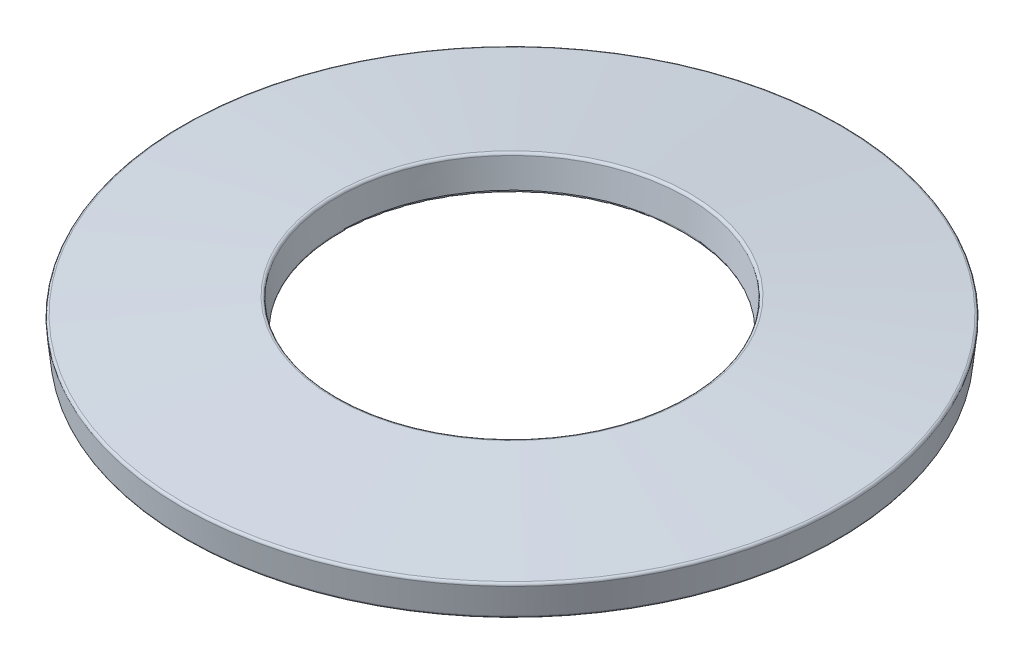
ISO-10303-21;
HEADER;
FILE_DESCRIPTION(('STEP AP214'),'2;1');
FILE_NAME('part.step','',(''),(''),'','','');
FILE_SCHEMA(('AUTOMOTIVE_DESIGN { 1 0 10303 214 1 1 1 1 }'));
ENDSEC;
DATA;
#1=APPLICATION_CONTEXT('core data for automotive mechanical design processes');
#2=APPLICATION_PROTOCOL_DEFINITION('international standard','automotive_design',2000,#1);
#3=PRODUCT_CONTEXT('',#1,'mechanical');
#4=PRODUCT('Part','Part','',(#3));
#5=PRODUCT_RELATED_PRODUCT_CATEGORY('part','',(#4));
#6=PRODUCT_DEFINITION_FORMATION('','',#4);
#7=PRODUCT_DEFINITION_CONTEXT('part definition',#1,'design');
#8=PRODUCT_DEFINITION('design','',#6,#7);
#9=PRODUCT_DEFINITION_SHAPE('','',#8);
#10=(LENGTH_UNIT() NAMED_UNIT(*) SI_UNIT(.MILLI.,.METRE.));
#11=(NAMED_UNIT(*) PLANE_ANGLE_UNIT() SI_UNIT($,.RADIAN.));
#12=(NAMED_UNIT(*) SI_UNIT($,.STERADIAN.) SOLID_ANGLE_UNIT());
#13=UNCERTAINTY_MEASURE_WITH_UNIT(LENGTH_MEASURE(1.E-05),#10,'distance_accuracy_value','');
#14=(GEOMETRIC_REPRESENTATION_CONTEXT(3) GLOBAL_UNCERTAINTY_ASSIGNED_CONTEXT((#13)) GLOBAL_UNIT_ASSIGNED_CONTEXT((#10,
#11,#12)) REPRESENTATION_CONTEXT('',''));
#15=CARTESIAN_POINT('',(0.,0.,0.));
#16=DIRECTION('',(0.,0.,1.));
#17=DIRECTION('',(1.,0.,0.));
#18=AXIS2_PLACEMENT_3D('',#15,#16,#17);
#19=CARTESIAN_POINT('',(0.,-0.122121355429971,0.));
#20=DIRECTION('',(0.,-1.,0.));
#21=DIRECTION('',(0.,0.,-1.));
#22=AXIS2_PLACEMENT_3D('',#19,#20,#21);
#23=CONICAL_SURFACE('',#22,2.6,1.46343877434843);
#24=CARTESIAN_POINT('',(0.,-0.126139534571328,0.));
#25=DIRECTION('',(0.,1.,0.));
#26=DIRECTION('',(0.,0.,1.));
#27=AXIS2_PLACEMENT_3D('',#24,#25,#26);
#28=CIRCLE('',#27,2.63728410165725);
#29=CARTESIAN_POINT('',(0.,-0.126139534571328,2.63728410165725));
#30=VERTEX_POINT('',#29);
#31=EDGE_CURVE('E56',#30,#30,#28,.T.);
#32=ORIENTED_EDGE('',*,*,#31,.T.);
#33=EDGE_LOOP('',(#32));
#34=FACE_BOUND('',#33,.T.);
#35=CARTESIAN_POINT('',(0.,-0.370981820858647,0.));
#36=DIRECTION('',(0.,1.,0.));
#37=DIRECTION('',(0.,0.,1.));
#38=AXIS2_PLACEMENT_3D('',#35,#36,#37);
#39=CIRCLE('',#38,4.909140176458);
#40=CARTESIAN_POINT('',(0.,-0.370981820858647,4.909140176458));
#41=VERTEX_POINT('',#40);
#42=EDGE_CURVE('E59',#41,#41,#39,.F.);
#43=ORIENTED_EDGE('',*,*,#42,.T.);
#44=EDGE_LOOP('',(#43));
#45=FACE_BOUND('',#44,.T.);
#46=ADVANCED_FACE('F30',(#34,#45),#23,.F.);
#47=CARTESIAN_POINT('',(0.,0.374999999999995,0.));
#48=DIRECTION('',(0.,1.,0.));
#49=DIRECTION('',(0.,0.,1.));
#50=AXIS2_PLACEMENT_3D('',#47,#48,#49);
#51=CONICAL_SURFACE('',#50,2.65357572188476,0.107357552446469);
#52=CARTESIAN_POINT('',(0.,-0.0848372537727259,0.));
#53=DIRECTION('',(0.,-1.,0.));
#54=DIRECTION('',(0.,0.,-1.));
#55=AXIS2_PLACEMENT_3D('',#52,#53,#54);
#56=CIRCLE('',#55,2.60401817914136);
#57=CARTESIAN_POINT('',(0.,-0.0848372537727259,-2.60401817914136));
#58=VERTEX_POINT('',#57);
#59=EDGE_CURVE('E50',#58,#58,#56,.T.);
#60=ORIENTED_EDGE('',*,*,#59,.T.);
#61=EDGE_LOOP('',(#60));
#62=FACE_BOUND('',#61,.T.);
#63=CARTESIAN_POINT('',(0.,0.33771589834275,0.));
#64=DIRECTION('',(0.,-1.,0.));
#65=DIRECTION('',(0.,0.,-1.));
#66=AXIS2_PLACEMENT_3D('',#63,#64,#65);
#67=CIRCLE('',#66,2.6495575427434);
#68=CARTESIAN_POINT('',(0.,0.33771589834275,-2.6495575427434));
#69=VERTEX_POINT('',#68);
#70=EDGE_CURVE('E53',#69,#69,#67,.F.);
#71=ORIENTED_EDGE('',*,*,#70,.T.);
#72=EDGE_LOOP('',(#71));
#73=FACE_BOUND('',#72,.T.);
#74=ADVANCED_FACE('F86',(#62,#73),#51,.F.);
#75=CARTESIAN_POINT('',(0.,0.122121355429962,0.));
#76=DIRECTION('',(0.,-1.,0.));
#77=DIRECTION('',(0.,0.,-1.));
#78=AXIS2_PLACEMENT_3D('',#75,#76,#77);
#79=CONICAL_SURFACE('',#78,5.,1.46343877434843);
#80=CARTESIAN_POINT('',(0.,0.126139534571319,0.));
#81=DIRECTION('',(0.,1.,0.));
#82=DIRECTION('',(0.,0.,1.));
#83=AXIS2_PLACEMENT_3D('',#80,#81,#82);
#84=CIRCLE('',#83,4.96271589834276);
#85=CARTESIAN_POINT('',(0.,0.126139534571319,4.96271589834276));
#86=VERTEX_POINT('',#85);
#87=EDGE_CURVE('E10',#86,#86,#84,.T.);
#88=ORIENTED_EDGE('',*,*,#87,.T.);
#89=EDGE_LOOP('',(#88));
#90=FACE_BOUND('',#89,.T.);
#91=CARTESIAN_POINT('',(0.,0.370981820858638,0.));
#92=DIRECTION('',(0.,1.,0.));
#93=DIRECTION('',(0.,0.,1.));
#94=AXIS2_PLACEMENT_3D('',#91,#92,#93);
#95=CIRCLE('',#94,2.69085982354201);
#96=CARTESIAN_POINT('',(0.,0.370981820858638,2.69085982354201));
#97=VERTEX_POINT('',#96);
#98=EDGE_CURVE('E37',#97,#97,#95,.F.);
#99=ORIENTED_EDGE('',*,*,#98,.T.);
#100=EDGE_LOOP('',(#99));
#101=FACE_BOUND('',#100,.T.);
#102=ADVANCED_FACE('F75',(#90,#101),#79,.T.);
#103=CARTESIAN_POINT('',(0.,-0.375000000000004,0.));
#104=DIRECTION('',(0.,1.,0.));
#105=DIRECTION('',(0.,0.,1.));
#106=AXIS2_PLACEMENT_3D('',#103,#104,#105);
#107=CONICAL_SURFACE('',#106,4.94642427811524,0.107357552446469);
#108=CARTESIAN_POINT('',(0.,-0.337715898342757,0.));
#109=DIRECTION('',(0.,-1.,0.));
#110=DIRECTION('',(0.,0.,-1.));
#111=AXIS2_PLACEMENT_3D('',#108,#109,#110);
#112=CIRCLE('',#111,4.9504424572566);
#113=CARTESIAN_POINT('',(0.,-0.337715898342757,-4.9504424572566));
#114=VERTEX_POINT('',#113);
#115=EDGE_CURVE('E41',#114,#114,#112,.F.);
#116=ORIENTED_EDGE('',*,*,#115,.T.);
#117=EDGE_LOOP('',(#116));
#118=FACE_BOUND('',#117,.T.);
#119=CARTESIAN_POINT('',(0.,0.0848372537727154,0.));
#120=DIRECTION('',(0.,-1.,0.));
#121=DIRECTION('',(0.,0.,-1.));
#122=AXIS2_PLACEMENT_3D('',#119,#120,#121);
#123=CIRCLE('',#122,4.99598182085865);
#124=CARTESIAN_POINT('',(0.,0.0848372537727154,-4.99598182085865));
#125=VERTEX_POINT('',#124);
#126=EDGE_CURVE('E45',#125,#125,#123,.T.);
#127=ORIENTED_EDGE('',*,*,#126,.T.);
#128=EDGE_LOOP('',(#127));
#129=FACE_BOUND('',#128,.T.);
#130=ADVANCED_FACE('F72',(#118,#129),#107,.T.);
#131=CARTESIAN_POINT('',(0.,-0.0888554329140809,0.));
#132=DIRECTION('',(0.,-1.,0.));
#133=DIRECTION('',(0.,0.,-1.));
#134=AXIS2_PLACEMENT_3D('',#131,#132,#133);
#135=TOROIDAL_SURFACE('',#134,2.6413022807986,0.0375);
#136=ORIENTED_EDGE('',*,*,#59,.F.);
#137=EDGE_LOOP('',(#136));
#138=FACE_BOUND('',#137,.T.);
#139=ORIENTED_EDGE('',*,*,#31,.F.);
#140=EDGE_LOOP('',(#139));
#141=FACE_BOUND('',#140,.T.);
#142=ADVANCED_FACE('F68',(#138,#141),#135,.T.);
#143=CARTESIAN_POINT('',(0.,-0.3336977192014,0.));
#144=DIRECTION('',(0.,-1.,0.));
#145=DIRECTION('',(0.,0.,-1.));
#146=AXIS2_PLACEMENT_3D('',#143,#144,#145);
#147=TOROIDAL_SURFACE('',#146,4.91315835559935,0.0375);
#148=ORIENTED_EDGE('',*,*,#42,.F.);
#149=EDGE_LOOP('',(#148));
#150=FACE_BOUND('',#149,.T.);
#151=ORIENTED_EDGE('',*,*,#115,.F.);
#152=EDGE_LOOP('',(#151));
#153=FACE_BOUND('',#152,.T.);
#154=ADVANCED_FACE('F64',(#150,#153),#147,.T.);
#155=CARTESIAN_POINT('',(0.,0.0888554329140718,0.));
#156=DIRECTION('',(0.,-1.,0.));
#157=DIRECTION('',(0.,0.,-1.));
#158=AXIS2_PLACEMENT_3D('',#155,#156,#157);
#159=TOROIDAL_SURFACE('',#158,4.9586977192014,0.0375);
#160=ORIENTED_EDGE('',*,*,#126,.F.);
#161=EDGE_LOOP('',(#160));
#162=FACE_BOUND('',#161,.T.);
#163=ORIENTED_EDGE('',*,*,#87,.F.);
#164=EDGE_LOOP('',(#163));
#165=FACE_BOUND('',#164,.T.);
#166=ADVANCED_FACE('F67',(#162,#165),#159,.T.);
#167=CARTESIAN_POINT('',(0.,0.333697719201391,0.));
#168=DIRECTION('',(0.,-1.,0.));
#169=DIRECTION('',(0.,0.,-1.));
#170=AXIS2_PLACEMENT_3D('',#167,#168,#169);
#171=TOROIDAL_SURFACE('',#170,2.68684164440065,0.0375);
#172=ORIENTED_EDGE('',*,*,#98,.F.);
#173=EDGE_LOOP('',(#172));
#174=FACE_BOUND('',#173,.T.);
#175=ORIENTED_EDGE('',*,*,#70,.F.);
#176=EDGE_LOOP('',(#175));
#177=FACE_BOUND('',#176,.T.);
#178=ADVANCED_FACE('F32',(#174,#177),#171,.T.);
#179=CLOSED_SHELL('',(#46,#74,#102,#130,#142,#154,#166,#178));
#180=MANIFOLD_SOLID_BREP('B2',#179);
#181=ADVANCED_BREP_SHAPE_REPRESENTATION('',(#18,#180),#14);
#182=SHAPE_DEFINITION_REPRESENTATION(#9,#181);
ENDSEC;
END-ISO-10303-21;
